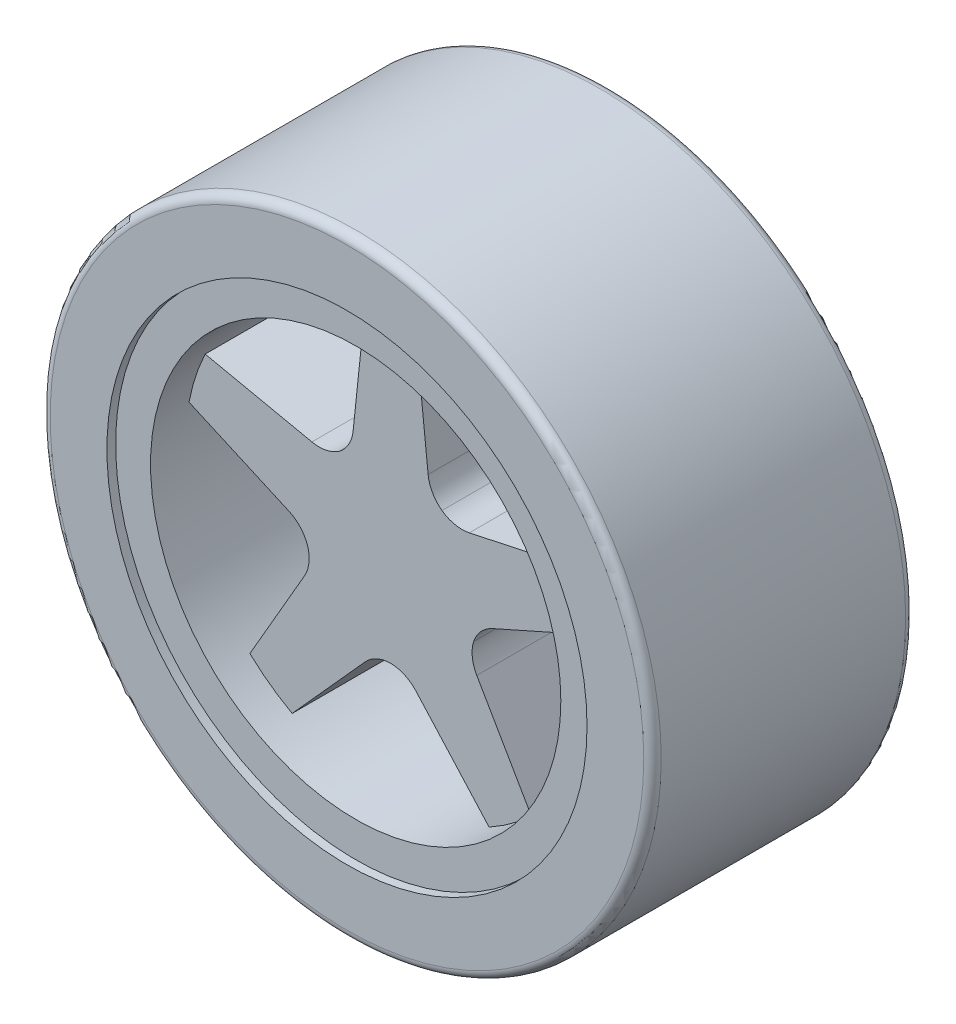
ISO-10303-21;
HEADER;
FILE_DESCRIPTION(('STEP AP214'),'2;1');
FILE_NAME('part.step','',(''),(''),'','','');
FILE_SCHEMA(('AUTOMOTIVE_DESIGN { 1 0 10303 214 1 1 1 1 }'));
ENDSEC;
DATA;
#1=APPLICATION_CONTEXT('core data for automotive mechanical design processes');
#2=APPLICATION_PROTOCOL_DEFINITION('international standard','automotive_design',2000,#1);
#3=PRODUCT_CONTEXT('',#1,'mechanical');
#4=PRODUCT('Part','Part','',(#3));
#5=PRODUCT_RELATED_PRODUCT_CATEGORY('part','',(#4));
#6=PRODUCT_DEFINITION_FORMATION('','',#4);
#7=PRODUCT_DEFINITION_CONTEXT('part definition',#1,'design');
#8=PRODUCT_DEFINITION('design','',#6,#7);
#9=PRODUCT_DEFINITION_SHAPE('','',#8);
#10=(LENGTH_UNIT() NAMED_UNIT(*) SI_UNIT(.MILLI.,.METRE.));
#11=(NAMED_UNIT(*) PLANE_ANGLE_UNIT() SI_UNIT($,.RADIAN.));
#12=(NAMED_UNIT(*) SI_UNIT($,.STERADIAN.) SOLID_ANGLE_UNIT());
#13=UNCERTAINTY_MEASURE_WITH_UNIT(LENGTH_MEASURE(1.E-05),#10,'distance_accuracy_value','');
#14=(GEOMETRIC_REPRESENTATION_CONTEXT(3) GLOBAL_UNCERTAINTY_ASSIGNED_CONTEXT((#13)) GLOBAL_UNIT_ASSIGNED_CONTEXT((#10,
#11,#12)) REPRESENTATION_CONTEXT('',''));
#15=CARTESIAN_POINT('',(0.,0.,0.));
#16=DIRECTION('',(0.,0.,1.));
#17=DIRECTION('',(1.,0.,0.));
#18=AXIS2_PLACEMENT_3D('',#15,#16,#17);
#19=CARTESIAN_POINT('',(0.,0.,14.));
#20=DIRECTION('',(0.,0.,-1.));
#21=DIRECTION('',(-1.,0.,0.));
#22=AXIS2_PLACEMENT_3D('',#19,#20,#21);
#23=CYLINDRICAL_SURFACE('',#22,23.5);
#24=CARTESIAN_POINT('',(0.,0.,14.));
#25=DIRECTION('',(0.,0.,1.));
#26=DIRECTION('',(1.,0.,0.));
#27=AXIS2_PLACEMENT_3D('',#24,#25,#26);
#28=CIRCLE('',#27,23.5);
#29=CARTESIAN_POINT('',(23.5,0.,14.));
#30=VERTEX_POINT('',#29);
#31=EDGE_CURVE('E366',#30,#30,#28,.T.);
#32=ORIENTED_EDGE('',*,*,#31,.T.);
#33=EDGE_LOOP('',(#32));
#34=FACE_BOUND('',#33,.T.);
#35=CARTESIAN_POINT('',(0.,0.,-14.));
#36=DIRECTION('',(0.,0.,1.));
#37=DIRECTION('',(1.,0.,0.));
#38=AXIS2_PLACEMENT_3D('',#35,#36,#37);
#39=CIRCLE('',#38,23.5);
#40=CARTESIAN_POINT('',(23.5,0.,-14.));
#41=VERTEX_POINT('',#40);
#42=EDGE_CURVE('E365',#41,#41,#39,.T.);
#43=ORIENTED_EDGE('',*,*,#42,.F.);
#44=EDGE_LOOP('',(#43));
#45=FACE_BOUND('',#44,.T.);
#46=DIRECTION('',(0.,0.,-1.));
#47=VECTOR('',#46,1.);
#48=CARTESIAN_POINT('',(-2.99388239988729,23.3085106382979,10.));
#49=LINE('',#48,#47);
#50=CARTESIAN_POINT('',(-2.9938823998873,23.3085106382979,10.));
#51=VERTEX_POINT('',#50);
#52=CARTESIAN_POINT('',(-2.99388239988729,23.3085106382979,-10.));
#53=VERTEX_POINT('',#52);
#54=EDGE_CURVE('E361',#51,#53,#49,.T.);
#55=ORIENTED_EDGE('',*,*,#54,.F.);
#56=CARTESIAN_POINT('',(0.,0.,10.));
#57=DIRECTION('',(0.,0.,1.));
#58=DIRECTION('',(-1.,0.,0.));
#59=AXIS2_PLACEMENT_3D('',#56,#57,#58);
#60=CIRCLE('',#59,23.5);
#61=CARTESIAN_POINT('',(2.9938823998873,23.3085106382979,10.));
#62=VERTEX_POINT('',#61);
#63=EDGE_CURVE('E338',#62,#51,#60,.T.);
#64=ORIENTED_EDGE('',*,*,#63,.F.);
#65=DIRECTION('',(0.,0.,-1.));
#66=VECTOR('',#65,1.);
#67=CARTESIAN_POINT('',(2.99388239988729,23.3085106382979,10.));
#68=LINE('',#67,#66);
#69=CARTESIAN_POINT('',(2.99388239988729,23.3085106382979,-10.));
#70=VERTEX_POINT('',#69);
#71=EDGE_CURVE('E349',#62,#70,#68,.T.);
#72=ORIENTED_EDGE('',*,*,#71,.T.);
#73=CARTESIAN_POINT('',(0.,0.,-10.));
#74=DIRECTION('',(0.,0.,1.));
#75=DIRECTION('',(-1.,0.,0.));
#76=AXIS2_PLACEMENT_3D('',#73,#74,#75);
#77=CIRCLE('',#76,23.5);
#78=EDGE_CURVE('E337',#70,#53,#77,.T.);
#79=ORIENTED_EDGE('',*,*,#78,.T.);
#80=EDGE_LOOP('',(#55,#64,#72,#79));
#81=FACE_BOUND('',#80,.T.);
#82=CARTESIAN_POINT('',(0.,0.,-10.));
#83=DIRECTION('',(0.,0.,1.));
#84=DIRECTION('',(0.809016994374951,0.587785252292469,0.));
#85=AXIS2_PLACEMENT_3D('',#82,#83,#84);
#86=CIRCLE('',#85,23.5);
#87=CARTESIAN_POINT('',(11.2782970654247,-20.6167411417041,-10.));
#88=VERTEX_POINT('',#87);
#89=CARTESIAN_POINT('',(16.1225005467625,-17.0972212982006,-10.));
#90=VERTEX_POINT('',#89);
#91=EDGE_CURVE('E279',#88,#90,#86,.T.);
#92=ORIENTED_EDGE('',*,*,#91,.T.);
#93=DIRECTION('',(0.,0.,-1.));
#94=VECTOR('',#93,1.);
#95=CARTESIAN_POINT('',(16.1225005467625,-17.0972212982006,10.));
#96=LINE('',#95,#94);
#97=CARTESIAN_POINT('',(16.1225005467625,-17.0972212982006,10.));
#98=VERTEX_POINT('',#97);
#99=EDGE_CURVE('E304',#98,#90,#96,.T.);
#100=ORIENTED_EDGE('',*,*,#99,.F.);
#101=CARTESIAN_POINT('',(0.,0.,10.));
#102=DIRECTION('',(0.,0.,1.));
#103=DIRECTION('',(0.809016994374951,0.587785252292469,0.));
#104=AXIS2_PLACEMENT_3D('',#101,#102,#103);
#105=CIRCLE('',#104,23.5);
#106=CARTESIAN_POINT('',(11.2782970654247,-20.6167411417041,10.));
#107=VERTEX_POINT('',#106);
#108=EDGE_CURVE('E297',#107,#98,#105,.T.);
#109=ORIENTED_EDGE('',*,*,#108,.F.);
#110=DIRECTION('',(0.,0.,-1.));
#111=VECTOR('',#110,1.);
#112=CARTESIAN_POINT('',(11.2782970654247,-20.6167411417041,10.));
#113=LINE('',#112,#111);
#114=EDGE_CURVE('E290',#107,#88,#113,.T.);
#115=ORIENTED_EDGE('',*,*,#114,.T.);
#116=EDGE_LOOP('',(#92,#100,#109,#115));
#117=FACE_BOUND('',#116,.T.);
#118=CARTESIAN_POINT('',(0.,0.,10.));
#119=DIRECTION('',(0.,0.,1.));
#120=DIRECTION('',(-0.309016994374958,-0.95105651629515,0.));
#121=AXIS2_PLACEMENT_3D('',#118,#119,#120);
#122=CIRCLE('',#121,23.5);
#123=CARTESIAN_POINT('',(-21.2425503869628,10.0500772662377,10.));
#124=VERTEX_POINT('',#123);
#125=CARTESIAN_POINT('',(-23.0928714684133,4.35537453536937,10.));
#126=VERTEX_POINT('',#125);
#127=EDGE_CURVE('E231',#124,#126,#122,.T.);
#128=ORIENTED_EDGE('',*,*,#127,.F.);
#129=DIRECTION('',(0.,0.,-1.));
#130=VECTOR('',#129,1.);
#131=CARTESIAN_POINT('',(-21.2425503869628,10.0500772662377,10.));
#132=LINE('',#131,#130);
#133=CARTESIAN_POINT('',(-21.2425503869628,10.0500772662377,-10.));
#134=VERTEX_POINT('',#133);
#135=EDGE_CURVE('E212',#124,#134,#132,.T.);
#136=ORIENTED_EDGE('',*,*,#135,.T.);
#137=CARTESIAN_POINT('',(0.,0.,-10.));
#138=DIRECTION('',(0.,0.,1.));
#139=DIRECTION('',(-0.309016994374958,-0.95105651629515,0.));
#140=AXIS2_PLACEMENT_3D('',#137,#138,#139);
#141=CIRCLE('',#140,23.5);
#142=CARTESIAN_POINT('',(-23.0928714684133,4.35537453536937,-10.));
#143=VERTEX_POINT('',#142);
#144=EDGE_CURVE('E218',#134,#143,#141,.T.);
#145=ORIENTED_EDGE('',*,*,#144,.T.);
#146=DIRECTION('',(0.,0.,-1.));
#147=VECTOR('',#146,1.);
#148=CARTESIAN_POINT('',(-23.0928714684133,4.35537453536937,10.));
#149=LINE('',#148,#147);
#150=EDGE_CURVE('E246',#126,#143,#149,.T.);
#151=ORIENTED_EDGE('',*,*,#150,.F.);
#152=EDGE_LOOP('',(#128,#136,#145,#151));
#153=FACE_BOUND('',#152,.T.);
#154=CARTESIAN_POINT('',(0.,0.,10.));
#155=DIRECTION('',(0.,0.,1.));
#156=DIRECTION('',(0.809016994374942,-0.58778525229248,0.));
#157=AXIS2_PLACEMENT_3D('',#154,#155,#156);
#158=CIRCLE('',#157,23.5);
#159=CARTESIAN_POINT('',(-16.1225005467627,-17.0972212982003,10.));
#160=VERTEX_POINT('',#159);
#161=CARTESIAN_POINT('',(-11.278297065425,-20.6167411417039,10.));
#162=VERTEX_POINT('',#161);
#163=EDGE_CURVE('E267',#160,#162,#158,.T.);
#164=ORIENTED_EDGE('',*,*,#163,.F.);
#165=DIRECTION('',(0.,0.,-1.));
#166=VECTOR('',#165,1.);
#167=CARTESIAN_POINT('',(-16.1225005467627,-17.0972212982003,10.));
#168=LINE('',#167,#166);
#169=CARTESIAN_POINT('',(-16.1225005467627,-17.0972212982003,-10.));
#170=VERTEX_POINT('',#169);
#171=EDGE_CURVE('E260',#160,#170,#168,.T.);
#172=ORIENTED_EDGE('',*,*,#171,.T.);
#173=CARTESIAN_POINT('',(0.,0.,-10.));
#174=DIRECTION('',(0.,0.,1.));
#175=DIRECTION('',(0.809016994374942,-0.58778525229248,0.));
#176=AXIS2_PLACEMENT_3D('',#173,#174,#175);
#177=CIRCLE('',#176,23.5);
#178=CARTESIAN_POINT('',(-11.278297065425,-20.6167411417039,-10.));
#179=VERTEX_POINT('',#178);
#180=EDGE_CURVE('E249',#170,#179,#177,.T.);
#181=ORIENTED_EDGE('',*,*,#180,.T.);
#182=DIRECTION('',(0.,0.,-1.));
#183=VECTOR('',#182,1.);
#184=CARTESIAN_POINT('',(-11.278297065425,-20.6167411417039,10.));
#185=LINE('',#184,#183);
#186=EDGE_CURVE('E275',#162,#179,#185,.T.);
#187=ORIENTED_EDGE('',*,*,#186,.F.);
#188=EDGE_LOOP('',(#164,#172,#181,#187));
#189=FACE_BOUND('',#188,.T.);
#190=CARTESIAN_POINT('',(0.,0.,-10.));
#191=DIRECTION('',(0.,0.,1.));
#192=DIRECTION('',(-0.309016994374945,0.951056516295155,0.));
#193=AXIS2_PLACEMENT_3D('',#190,#191,#192);
#194=CIRCLE('',#193,23.5);
#195=CARTESIAN_POINT('',(23.0928714684133,4.35537453536905,-10.));
#196=VERTEX_POINT('',#195);
#197=CARTESIAN_POINT('',(21.2425503869629,10.0500772662374,-10.));
#198=VERTEX_POINT('',#197);
#199=EDGE_CURVE('E308',#196,#198,#194,.T.);
#200=ORIENTED_EDGE('',*,*,#199,.T.);
#201=DIRECTION('',(0.,0.,-1.));
#202=VECTOR('',#201,1.);
#203=CARTESIAN_POINT('',(21.2425503869629,10.0500772662374,10.));
#204=LINE('',#203,#202);
#205=CARTESIAN_POINT('',(21.2425503869629,10.0500772662374,10.));
#206=VERTEX_POINT('',#205);
#207=EDGE_CURVE('E333',#206,#198,#204,.T.);
#208=ORIENTED_EDGE('',*,*,#207,.F.);
#209=CARTESIAN_POINT('',(0.,0.,10.));
#210=DIRECTION('',(0.,0.,1.));
#211=DIRECTION('',(-0.309016994374945,0.951056516295155,0.));
#212=AXIS2_PLACEMENT_3D('',#209,#210,#211);
#213=CIRCLE('',#212,23.5);
#214=CARTESIAN_POINT('',(23.0928714684133,4.35537453536904,10.));
#215=VERTEX_POINT('',#214);
#216=EDGE_CURVE('E325',#215,#206,#213,.T.);
#217=ORIENTED_EDGE('',*,*,#216,.F.);
#218=DIRECTION('',(0.,0.,-1.));
#219=VECTOR('',#218,1.);
#220=CARTESIAN_POINT('',(23.0928714684133,4.35537453536905,10.));
#221=LINE('',#220,#219);
#222=EDGE_CURVE('E318',#215,#196,#221,.T.);
#223=ORIENTED_EDGE('',*,*,#222,.T.);
#224=EDGE_LOOP('',(#200,#208,#217,#223));
#225=FACE_BOUND('',#224,.T.);
#226=ADVANCED_FACE('F39',(#34,#45,#81,#117,#153,#189,#225),#23,.F.);
#227=CARTESIAN_POINT('',(0.,0.,15.));
#228=DIRECTION('',(0.,0.,-1.));
#229=DIRECTION('',(-1.,0.,0.));
#230=AXIS2_PLACEMENT_3D('',#227,#228,#229);
#231=CYLINDRICAL_SURFACE('',#230,27.5);
#232=CARTESIAN_POINT('',(0.,0.,-15.));
#233=DIRECTION('',(0.,0.,1.));
#234=DIRECTION('',(1.,0.,0.));
#235=AXIS2_PLACEMENT_3D('',#232,#233,#234);
#236=CIRCLE('',#235,27.5);
#237=CARTESIAN_POINT('',(27.5,0.,-15.));
#238=VERTEX_POINT('',#237);
#239=EDGE_CURVE('E377',#238,#238,#236,.T.);
#240=ORIENTED_EDGE('',*,*,#239,.F.);
#241=EDGE_LOOP('',(#240));
#242=FACE_BOUND('',#241,.T.);
#243=CARTESIAN_POINT('',(0.,0.,-14.));
#244=DIRECTION('',(0.,0.,1.));
#245=DIRECTION('',(1.,0.,0.));
#246=AXIS2_PLACEMENT_3D('',#243,#244,#245);
#247=CIRCLE('',#246,27.5);
#248=CARTESIAN_POINT('',(27.5,0.,-14.));
#249=VERTEX_POINT('',#248);
#250=EDGE_CURVE('E370',#249,#249,#247,.T.);
#251=ORIENTED_EDGE('',*,*,#250,.T.);
#252=EDGE_LOOP('',(#251));
#253=FACE_BOUND('',#252,.T.);
#254=ADVANCED_FACE('F615',(#242,#253),#231,.F.);
#255=CARTESIAN_POINT('',(0.,0.,15.));
#256=DIRECTION('',(0.,0.,1.));
#257=DIRECTION('',(1.,0.,0.));
#258=AXIS2_PLACEMENT_3D('',#255,#256,#257);
#259=PLANE('',#258);
#260=CARTESIAN_POINT('',(0.,0.,15.));
#261=DIRECTION('',(0.,0.,1.));
#262=DIRECTION('',(1.,0.,0.));
#263=AXIS2_PLACEMENT_3D('',#260,#261,#262);
#264=CIRCLE('',#263,34.);
#265=CARTESIAN_POINT('',(34.,0.,15.));
#266=VERTEX_POINT('',#265);
#267=EDGE_CURVE('E397',#266,#266,#264,.T.);
#268=ORIENTED_EDGE('',*,*,#267,.T.);
#269=EDGE_LOOP('',(#268));
#270=FACE_BOUND('',#269,.T.);
#271=CARTESIAN_POINT('',(0.,0.,15.));
#272=DIRECTION('',(0.,0.,1.));
#273=DIRECTION('',(1.,0.,0.));
#274=AXIS2_PLACEMENT_3D('',#271,#272,#273);
#275=CIRCLE('',#274,27.5);
#276=CARTESIAN_POINT('',(27.5,0.,15.));
#277=VERTEX_POINT('',#276);
#278=EDGE_CURVE('E378',#277,#277,#275,.T.);
#279=ORIENTED_EDGE('',*,*,#278,.F.);
#280=EDGE_LOOP('',(#279));
#281=FACE_BOUND('',#280,.T.);
#282=ADVANCED_FACE('F620',(#270,#281),#259,.T.);
#283=CARTESIAN_POINT('',(0.,0.,-15.));
#284=DIRECTION('',(0.,0.,1.));
#285=DIRECTION('',(1.,0.,0.));
#286=AXIS2_PLACEMENT_3D('',#283,#284,#285);
#287=PLANE('',#286);
#288=CARTESIAN_POINT('',(0.,0.,-15.));
#289=DIRECTION('',(0.,0.,1.));
#290=DIRECTION('',(1.,0.,0.));
#291=AXIS2_PLACEMENT_3D('',#288,#289,#290);
#292=CIRCLE('',#291,34.);
#293=CARTESIAN_POINT('',(34.,0.,-15.));
#294=VERTEX_POINT('',#293);
#295=EDGE_CURVE('E393',#294,#294,#292,.F.);
#296=ORIENTED_EDGE('',*,*,#295,.T.);
#297=EDGE_LOOP('',(#296));
#298=FACE_BOUND('',#297,.T.);
#299=ORIENTED_EDGE('',*,*,#239,.T.);
#300=EDGE_LOOP('',(#299));
#301=FACE_BOUND('',#300,.T.);
#302=ADVANCED_FACE('F636',(#298,#301),#287,.F.);
#303=CARTESIAN_POINT('',(0.,0.,15.));
#304=DIRECTION('',(0.,0.,-1.));
#305=DIRECTION('',(-1.,0.,0.));
#306=AXIS2_PLACEMENT_3D('',#303,#304,#305);
#307=CYLINDRICAL_SURFACE('',#306,35.);
#308=CARTESIAN_POINT('',(0.,0.,-14.));
#309=DIRECTION('',(0.,0.,1.));
#310=DIRECTION('',(1.,0.,0.));
#311=AXIS2_PLACEMENT_3D('',#308,#309,#310);
#312=CIRCLE('',#311,35.);
#313=CARTESIAN_POINT('',(35.,0.,-14.));
#314=VERTEX_POINT('',#313);
#315=EDGE_CURVE('E389',#314,#314,#312,.T.);
#316=ORIENTED_EDGE('',*,*,#315,.T.);
#317=EDGE_LOOP('',(#316));
#318=FACE_BOUND('',#317,.T.);
#319=CARTESIAN_POINT('',(0.,0.,14.));
#320=DIRECTION('',(0.,0.,1.));
#321=DIRECTION('',(1.,0.,0.));
#322=AXIS2_PLACEMENT_3D('',#319,#320,#321);
#323=CIRCLE('',#322,35.);
#324=CARTESIAN_POINT('',(35.,0.,14.));
#325=VERTEX_POINT('',#324);
#326=EDGE_CURVE('E382',#325,#325,#323,.F.);
#327=ORIENTED_EDGE('',*,*,#326,.T.);
#328=EDGE_LOOP('',(#327));
#329=FACE_BOUND('',#328,.T.);
#330=ADVANCED_FACE('F632',(#318,#329),#307,.T.);
#331=CARTESIAN_POINT('',(0.,0.,14.));
#332=DIRECTION('',(0.,0.,1.));
#333=DIRECTION('',(1.,0.,0.));
#334=AXIS2_PLACEMENT_3D('',#331,#332,#333);
#335=CIRCLE('',#334,27.5);
#336=CARTESIAN_POINT('',(27.5,0.,14.));
#337=VERTEX_POINT('',#336);
#338=EDGE_CURVE('E401',#337,#337,#335,.T.);
#339=ORIENTED_EDGE('',*,*,#338,.F.);
#340=EDGE_LOOP('',(#339));
#341=FACE_BOUND('',#340,.T.);
#342=ORIENTED_EDGE('',*,*,#278,.T.);
#343=EDGE_LOOP('',(#342));
#344=FACE_BOUND('',#343,.T.);
#345=ADVANCED_FACE('F623',(#341,#344),#231,.F.);
#346=CARTESIAN_POINT('',(0.,0.,-14.));
#347=DIRECTION('',(0.,0.,1.));
#348=DIRECTION('',(1.,0.,0.));
#349=AXIS2_PLACEMENT_3D('',#346,#347,#348);
#350=TOROIDAL_SURFACE('',#349,34.,1.);
#351=ORIENTED_EDGE('',*,*,#295,.F.);
#352=EDGE_LOOP('',(#351));
#353=FACE_BOUND('',#352,.T.);
#354=ORIENTED_EDGE('',*,*,#315,.F.);
#355=EDGE_LOOP('',(#354));
#356=FACE_BOUND('',#355,.T.);
#357=ADVANCED_FACE('F631',(#353,#356),#350,.T.);
#358=CARTESIAN_POINT('',(0.,0.,14.));
#359=DIRECTION('',(0.,0.,1.));
#360=DIRECTION('',(1.,0.,0.));
#361=AXIS2_PLACEMENT_3D('',#358,#359,#360);
#362=TOROIDAL_SURFACE('',#361,34.,1.);
#363=ORIENTED_EDGE('',*,*,#326,.F.);
#364=EDGE_LOOP('',(#363));
#365=FACE_BOUND('',#364,.T.);
#366=ORIENTED_EDGE('',*,*,#267,.F.);
#367=EDGE_LOOP('',(#366));
#368=FACE_BOUND('',#367,.T.);
#369=ADVANCED_FACE('F627',(#365,#368),#362,.T.);
#370=CARTESIAN_POINT('',(0.,0.,14.));
#371=DIRECTION('',(0.,0.,1.));
#372=DIRECTION('',(1.,0.,0.));
#373=AXIS2_PLACEMENT_3D('',#370,#371,#372);
#374=PLANE('',#373);
#375=ORIENTED_EDGE('',*,*,#338,.T.);
#376=EDGE_LOOP('',(#375));
#377=FACE_BOUND('',#376,.T.);
#378=ORIENTED_EDGE('',*,*,#31,.F.);
#379=EDGE_LOOP('',(#378));
#380=FACE_BOUND('',#379,.T.);
#381=ADVANCED_FACE('F610',(#377,#380),#374,.T.);
#382=CARTESIAN_POINT('',(0.,0.,-14.));
#383=DIRECTION('',(0.,0.,1.));
#384=DIRECTION('',(1.,0.,0.));
#385=AXIS2_PLACEMENT_3D('',#382,#383,#384);
#386=PLANE('',#385);
#387=ORIENTED_EDGE('',*,*,#250,.F.);
#388=EDGE_LOOP('',(#387));
#389=FACE_BOUND('',#388,.T.);
#390=ORIENTED_EDGE('',*,*,#42,.T.);
#391=EDGE_LOOP('',(#390));
#392=FACE_BOUND('',#391,.T.);
#393=ADVANCED_FACE('F603',(#389,#392),#386,.F.);
#394=CARTESIAN_POINT('',(-2.99388239988729,23.3085106382979,10.));
#395=DIRECTION('',(0.994558469357222,-0.104179897436208,0.));
#396=DIRECTION('',(0.104179897436208,0.994558469357222,0.));
#397=AXIS2_PLACEMENT_3D('',#394,#395,#396);
#398=PLANE('',#397);
#399=DIRECTION('',(-0.104179897436208,-0.994558469357222,0.));
#400=VECTOR('',#399,1.);
#401=CARTESIAN_POINT('',(-2.99388239988729,23.3085106382979,-10.));
#402=LINE('',#401,#400);
#403=CARTESIAN_POINT('',(-4.29614416433073,10.8764052223719,-10.));
#404=VERTEX_POINT('',#403);
#405=EDGE_CURVE('E352',#53,#404,#402,.T.);
#406=ORIENTED_EDGE('',*,*,#405,.T.);
#407=DIRECTION('',(0.,0.,1.));
#408=VECTOR('',#407,1.);
#409=CARTESIAN_POINT('',(-4.29614416433073,10.8764052223719,10.));
#410=LINE('',#409,#408);
#411=CARTESIAN_POINT('',(-4.29614416433073,10.8764052223719,10.));
#412=VERTEX_POINT('',#411);
#413=EDGE_CURVE('E433',#404,#412,#410,.T.);
#414=ORIENTED_EDGE('',*,*,#413,.T.);
#415=DIRECTION('',(-0.104179897436208,-0.994558469357222,0.));
#416=VECTOR('',#415,1.);
#417=CARTESIAN_POINT('',(-2.99388239988729,23.3085106382979,10.));
#418=LINE('',#417,#416);
#419=EDGE_CURVE('E342',#51,#412,#418,.T.);
#420=ORIENTED_EDGE('',*,*,#419,.F.);
#421=ORIENTED_EDGE('',*,*,#54,.T.);
#422=EDGE_LOOP('',(#406,#414,#420,#421));
#423=FACE_BOUND('',#422,.T.);
#424=ADVANCED_FACE('F601',(#423),#398,.F.);
#425=CARTESIAN_POINT('',(2.99388239988729,23.3085106382979,10.));
#426=DIRECTION('',(-0.994558469357222,-0.104179897436208,0.));
#427=DIRECTION('',(0.104179897436208,-0.994558469357222,0.));
#428=AXIS2_PLACEMENT_3D('',#425,#426,#427);
#429=PLANE('',#428);
#430=DIRECTION('',(-0.104179897436208,0.994558469357222,0.));
#431=VECTOR('',#430,1.);
#432=CARTESIAN_POINT('',(2.99388239988729,23.3085106382979,10.));
#433=LINE('',#432,#431);
#434=CARTESIAN_POINT('',(4.29614416433073,10.8764052223719,10.));
#435=VERTEX_POINT('',#434);
#436=EDGE_CURVE('E346',#435,#62,#433,.T.);
#437=ORIENTED_EDGE('',*,*,#436,.F.);
#438=DIRECTION('',(0.,0.,1.));
#439=VECTOR('',#438,1.);
#440=CARTESIAN_POINT('',(4.29614416433073,10.8764052223719,-10.));
#441=LINE('',#440,#439);
#442=CARTESIAN_POINT('',(4.29614416433073,10.8764052223719,-10.));
#443=VERTEX_POINT('',#442);
#444=EDGE_CURVE('E430',#435,#443,#441,.F.);
#445=ORIENTED_EDGE('',*,*,#444,.T.);
#446=DIRECTION('',(-0.104179897436208,0.994558469357222,0.));
#447=VECTOR('',#446,1.);
#448=CARTESIAN_POINT('',(2.99388239988729,23.3085106382979,-10.));
#449=LINE('',#448,#447);
#450=EDGE_CURVE('E343',#443,#70,#449,.T.);
#451=ORIENTED_EDGE('',*,*,#450,.T.);
#452=ORIENTED_EDGE('',*,*,#71,.F.);
#453=EDGE_LOOP('',(#437,#445,#451,#452));
#454=FACE_BOUND('',#453,.T.);
#455=ADVANCED_FACE('F593',(#454),#429,.F.);
#456=CARTESIAN_POINT('',(0.,0.,10.));
#457=DIRECTION('',(0.,0.,-1.));
#458=DIRECTION('',(-1.,0.,0.));
#459=AXIS2_PLACEMENT_3D('',#456,#457,#458);
#460=PLANE('',#459);
#461=CARTESIAN_POINT('',(8.18347650911149,11.3591686414465,10.));
#462=DIRECTION('',(0.,0.,-1.));
#463=DIRECTION('',(-1.,0.,0.));
#464=AXIS2_PLACEMENT_3D('',#461,#462,#463);
#465=CIRCLE('',#464,4.);
#466=CARTESIAN_POINT('',(9.01649450354047,7.44686995385145,10.));
#467=VERTEX_POINT('',#466);
#468=CARTESIAN_POINT('',(5.87801817507618,8.0903979443759,10.));
#469=VERTEX_POINT('',#468);
#470=EDGE_CURVE('E478',#467,#469,#465,.T.);
#471=ORIENTED_EDGE('',*,*,#470,.T.);
#472=CARTESIAN_POINT('',(8.27437804175962,11.2931248121167,10.));
#473=DIRECTION('',(0.,0.,-1.));
#474=DIRECTION('',(-1.,0.,0.));
#475=AXIS2_PLACEMENT_3D('',#472,#473,#474);
#476=CIRCLE('',#475,4.);
#477=EDGE_CURVE('E484',#469,#435,#476,.T.);
#478=ORIENTED_EDGE('',*,*,#477,.T.);
#479=ORIENTED_EDGE('',*,*,#436,.T.);
#480=ORIENTED_EDGE('',*,*,#63,.T.);
#481=ORIENTED_EDGE('',*,*,#419,.T.);
#482=CARTESIAN_POINT('',(-8.27437804175962,11.2931248121167,10.));
#483=DIRECTION('',(0.,0.,-1.));
#484=DIRECTION('',(-1.,0.,0.));
#485=AXIS2_PLACEMENT_3D('',#482,#483,#484);
#486=CIRCLE('',#485,4.);
#487=CARTESIAN_POINT('',(-5.87801817507623,8.09039794437586,10.));
#488=VERTEX_POINT('',#487);
#489=EDGE_CURVE('E56',#412,#488,#486,.T.);
#490=ORIENTED_EDGE('',*,*,#489,.T.);
#491=CARTESIAN_POINT('',(-8.18347650911133,11.3591686414466,10.));
#492=DIRECTION('',(0.,0.,-1.));
#493=DIRECTION('',(-1.,0.,0.));
#494=AXIS2_PLACEMENT_3D('',#491,#492,#493);
#495=CIRCLE('',#494,4.);
#496=CARTESIAN_POINT('',(-9.01649450354038,7.44686995385158,10.));
#497=VERTEX_POINT('',#496);
#498=EDGE_CURVE('E11',#488,#497,#495,.T.);
#499=ORIENTED_EDGE('',*,*,#498,.T.);
#500=DIRECTION('',(-0.978074671898745,0.208254498607262,0.));
#501=VECTOR('',#500,1.);
#502=CARTESIAN_POINT('',(-21.2425503869628,10.0500772662377,10.));
#503=LINE('',#502,#501);
#504=EDGE_CURVE('E233',#497,#124,#503,.T.);
#505=ORIENTED_EDGE('',*,*,#504,.T.);
#506=ORIENTED_EDGE('',*,*,#127,.T.);
#507=DIRECTION('',(0.913687954338688,-0.406416439254594,0.));
#508=VECTOR('',#507,1.);
#509=CARTESIAN_POINT('',(-23.0928714684133,4.35537453536937,10.));
#510=LINE('',#509,#508);
#511=CARTESIAN_POINT('',(-11.6716576176664,-0.724881851008666,10.));
#512=VERTEX_POINT('',#511);
#513=EDGE_CURVE('E242',#126,#512,#510,.T.);
#514=ORIENTED_EDGE('',*,*,#513,.T.);
#515=CARTESIAN_POINT('',(-13.2973233746848,-4.37963366836342,10.));
#516=DIRECTION('',(0.,0.,-1.));
#517=DIRECTION('',(-1.,0.,0.));
#518=AXIS2_PLACEMENT_3D('',#515,#516,#517);
#519=CIRCLE('',#518,4.);
#520=CARTESIAN_POINT('',(-9.51083319376296,-3.09025703223927,10.));
#521=VERTEX_POINT('',#520);
#522=EDGE_CURVE('E448',#512,#521,#519,.T.);
#523=ORIENTED_EDGE('',*,*,#522,.T.);
#524=CARTESIAN_POINT('',(-13.3320446705269,-4.27277250776071,10.));
#525=DIRECTION('',(0.,0.,-1.));
#526=DIRECTION('',(-1.,0.,0.));
#527=AXIS2_PLACEMENT_3D('',#524,#525,#526);
#528=CIRCLE('',#527,4.);
#529=CARTESIAN_POINT('',(-9.86864422689541,-6.27398648109122,10.));
#530=VERTEX_POINT('',#529);
#531=EDGE_CURVE('E442',#521,#530,#528,.T.);
#532=ORIENTED_EDGE('',*,*,#531,.T.);
#533=DIRECTION('',(-0.500303493332627,-0.86585011090787,0.));
#534=VECTOR('',#533,1.);
#535=CARTESIAN_POINT('',(-16.1225005467627,-17.0972212982003,10.));
#536=LINE('',#535,#534);
#537=EDGE_CURVE('E264',#530,#160,#536,.T.);
#538=ORIENTED_EDGE('',*,*,#537,.T.);
#539=ORIENTED_EDGE('',*,*,#163,.T.);
#540=DIRECTION('',(0.668870108328889,0.743379296311177,0.));
#541=VECTOR('',#540,1.);
#542=CARTESIAN_POINT('',(-11.278297065425,-20.6167411417039,10.));
#543=LINE('',#542,#541);
#544=CARTESIAN_POINT('',(-2.91733694843881,-11.3244068441232,10.));
#545=VERTEX_POINT('',#544);
#546=EDGE_CURVE('E271',#162,#545,#543,.T.);
#547=ORIENTED_EDGE('',*,*,#546,.T.);
#548=CARTESIAN_POINT('',(0.0561802368058903,-13.9998872774388,10.));
#549=DIRECTION('',(0.,0.,-1.));
#550=DIRECTION('',(-1.,0.,0.));
#551=AXIS2_PLACEMENT_3D('',#548,#549,#550);
#552=CIRCLE('',#551,4.);
#553=CARTESIAN_POINT('',(-1.05818132034585E-13,-10.0002818242731,10.));
#554=VERTEX_POINT('',#553);
#555=EDGE_CURVE('E460',#545,#554,#552,.T.);
#556=ORIENTED_EDGE('',*,*,#555,.T.);
#557=CARTESIAN_POINT('',(-0.0561802368061019,-13.9998872774388,10.));
#558=DIRECTION('',(0.,0.,-1.));
#559=DIRECTION('',(-1.,0.,0.));
#560=AXIS2_PLACEMENT_3D('',#557,#558,#559);
#561=CIRCLE('',#560,4.);
#562=CARTESIAN_POINT('',(2.91733694843864,-11.3244068441233,10.));
#563=VERTEX_POINT('',#562);
#564=EDGE_CURVE('E454',#554,#563,#561,.T.);
#565=ORIENTED_EDGE('',*,*,#564,.T.);
#566=DIRECTION('',(0.668870108328878,-0.743379296311186,0.));
#567=VECTOR('',#566,1.);
#568=CARTESIAN_POINT('',(11.2782970654247,-20.6167411417041,10.));
#569=LINE('',#568,#567);
#570=EDGE_CURVE('E294',#563,#107,#569,.T.);
#571=ORIENTED_EDGE('',*,*,#570,.T.);
#572=ORIENTED_EDGE('',*,*,#108,.T.);
#573=DIRECTION('',(-0.500303493332614,0.865850110907877,0.));
#574=VECTOR('',#573,1.);
#575=CARTESIAN_POINT('',(16.1225005467625,-17.0972212982006,10.));
#576=LINE('',#575,#574);
#577=CARTESIAN_POINT('',(9.86864422689531,-6.27398648109136,10.));
#578=VERTEX_POINT('',#577);
#579=EDGE_CURVE('E300',#98,#578,#576,.T.);
#580=ORIENTED_EDGE('',*,*,#579,.T.);
#581=CARTESIAN_POINT('',(13.3320446705268,-4.27277250776091,10.));
#582=DIRECTION('',(0.,0.,-1.));
#583=DIRECTION('',(-1.,0.,0.));
#584=AXIS2_PLACEMENT_3D('',#581,#582,#583);
#585=CIRCLE('',#584,4.);
#586=CARTESIAN_POINT('',(9.51083319376291,-3.09025703223944,10.));
#587=VERTEX_POINT('',#586);
#588=EDGE_CURVE('E472',#578,#587,#585,.T.);
#589=ORIENTED_EDGE('',*,*,#588,.T.);
#590=CARTESIAN_POINT('',(13.2973233746847,-4.37963366836362,10.));
#591=DIRECTION('',(0.,0.,-1.));
#592=DIRECTION('',(-1.,0.,0.));
#593=AXIS2_PLACEMENT_3D('',#590,#591,#592);
#594=CIRCLE('',#593,4.);
#595=CARTESIAN_POINT('',(11.6716576176664,-0.724881851008839,10.));
#596=VERTEX_POINT('',#595);
#597=EDGE_CURVE('E466',#587,#596,#594,.T.);
#598=ORIENTED_EDGE('',*,*,#597,.T.);
#599=DIRECTION('',(0.913687954338694,0.406416439254581,0.));
#600=VECTOR('',#599,1.);
#601=CARTESIAN_POINT('',(23.0928714684133,4.35537453536905,10.));
#602=LINE('',#601,#600);
#603=EDGE_CURVE('E322',#596,#215,#602,.T.);
#604=ORIENTED_EDGE('',*,*,#603,.T.);
#605=ORIENTED_EDGE('',*,*,#216,.T.);
#606=DIRECTION('',(-0.978074671898749,-0.208254498607248,0.));
#607=VECTOR('',#606,1.);
#608=CARTESIAN_POINT('',(21.2425503869629,10.0500772662374,10.));
#609=LINE('',#608,#607);
#610=EDGE_CURVE('E329',#206,#467,#609,.T.);
#611=ORIENTED_EDGE('',*,*,#610,.T.);
#612=EDGE_LOOP('',(#471,#478,#479,#480,#481,#490,#499,#505,#506,#514,#523,#532,#538,#539,#547,
#556,#565,#571,#572,#580,#589,#598,#604,#605,#611));
#613=FACE_BOUND('',#612,.T.);
#614=ADVANCED_FACE('F517',(#613),#460,.F.);
#615=CARTESIAN_POINT('',(0.,0.,-10.));
#616=DIRECTION('',(0.,0.,-1.));
#617=DIRECTION('',(-1.,0.,0.));
#618=AXIS2_PLACEMENT_3D('',#615,#616,#617);
#619=PLANE('',#618);
#620=DIRECTION('',(-0.978074671898745,0.208254498607262,0.));
#621=VECTOR('',#620,1.);
#622=CARTESIAN_POINT('',(-21.2425503869628,10.0500772662377,-10.));
#623=LINE('',#622,#621);
#624=CARTESIAN_POINT('',(-9.01649450354038,7.44686995385158,-10.));
#625=VERTEX_POINT('',#624);
#626=EDGE_CURVE('E207',#625,#134,#623,.T.);
#627=ORIENTED_EDGE('',*,*,#626,.F.);
#628=CARTESIAN_POINT('',(-8.18347650911133,11.3591686414466,-10.));
#629=DIRECTION('',(0.,0.,-1.));
#630=DIRECTION('',(-1.,0.,0.));
#631=AXIS2_PLACEMENT_3D('',#628,#629,#630);
#632=CIRCLE('',#631,4.);
#633=CARTESIAN_POINT('',(-5.87801817507623,8.09039794437586,-10.));
#634=VERTEX_POINT('',#633);
#635=EDGE_CURVE('E49',#625,#634,#632,.F.);
#636=ORIENTED_EDGE('',*,*,#635,.T.);
#637=CARTESIAN_POINT('',(-8.27437804175962,11.2931248121167,-10.));
#638=DIRECTION('',(0.,0.,-1.));
#639=DIRECTION('',(-1.,0.,0.));
#640=AXIS2_PLACEMENT_3D('',#637,#638,#639);
#641=CIRCLE('',#640,4.);
#642=EDGE_CURVE('E487',#634,#404,#641,.F.);
#643=ORIENTED_EDGE('',*,*,#642,.T.);
#644=ORIENTED_EDGE('',*,*,#405,.F.);
#645=ORIENTED_EDGE('',*,*,#78,.F.);
#646=ORIENTED_EDGE('',*,*,#450,.F.);
#647=CARTESIAN_POINT('',(8.27437804175962,11.2931248121167,-10.));
#648=DIRECTION('',(0.,0.,-1.));
#649=DIRECTION('',(-1.,0.,0.));
#650=AXIS2_PLACEMENT_3D('',#647,#648,#649);
#651=CIRCLE('',#650,4.);
#652=CARTESIAN_POINT('',(5.87801817507618,8.0903979443759,-10.));
#653=VERTEX_POINT('',#652);
#654=EDGE_CURVE('E481',#443,#653,#651,.F.);
#655=ORIENTED_EDGE('',*,*,#654,.T.);
#656=CARTESIAN_POINT('',(8.18347650911149,11.3591686414465,-10.));
#657=DIRECTION('',(0.,0.,-1.));
#658=DIRECTION('',(-1.,0.,0.));
#659=AXIS2_PLACEMENT_3D('',#656,#657,#658);
#660=CIRCLE('',#659,4.);
#661=CARTESIAN_POINT('',(9.01649450354047,7.44686995385145,-10.));
#662=VERTEX_POINT('',#661);
#663=EDGE_CURVE('E475',#653,#662,#660,.F.);
#664=ORIENTED_EDGE('',*,*,#663,.T.);
#665=DIRECTION('',(-0.978074671898749,-0.208254498607248,0.));
#666=VECTOR('',#665,1.);
#667=CARTESIAN_POINT('',(21.2425503869629,10.0500772662374,-10.));
#668=LINE('',#667,#666);
#669=EDGE_CURVE('E314',#198,#662,#668,.T.);
#670=ORIENTED_EDGE('',*,*,#669,.F.);
#671=ORIENTED_EDGE('',*,*,#199,.F.);
#672=DIRECTION('',(0.913687954338694,0.406416439254581,0.));
#673=VECTOR('',#672,1.);
#674=CARTESIAN_POINT('',(23.0928714684133,4.35537453536905,-10.));
#675=LINE('',#674,#673);
#676=CARTESIAN_POINT('',(11.6716576176664,-0.724881851008839,-10.));
#677=VERTEX_POINT('',#676);
#678=EDGE_CURVE('E311',#677,#196,#675,.T.);
#679=ORIENTED_EDGE('',*,*,#678,.F.);
#680=CARTESIAN_POINT('',(13.2973233746847,-4.37963366836362,-10.));
#681=DIRECTION('',(0.,0.,-1.));
#682=DIRECTION('',(-1.,0.,0.));
#683=AXIS2_PLACEMENT_3D('',#680,#681,#682);
#684=CIRCLE('',#683,4.);
#685=CARTESIAN_POINT('',(9.51083319376291,-3.09025703223944,-10.));
#686=VERTEX_POINT('',#685);
#687=EDGE_CURVE('E463',#677,#686,#684,.F.);
#688=ORIENTED_EDGE('',*,*,#687,.T.);
#689=CARTESIAN_POINT('',(13.3320446705268,-4.27277250776091,-10.));
#690=DIRECTION('',(0.,0.,-1.));
#691=DIRECTION('',(-1.,0.,0.));
#692=AXIS2_PLACEMENT_3D('',#689,#690,#691);
#693=CIRCLE('',#692,4.);
#694=CARTESIAN_POINT('',(9.86864422689531,-6.27398648109136,-10.));
#695=VERTEX_POINT('',#694);
#696=EDGE_CURVE('E469',#686,#695,#693,.F.);
#697=ORIENTED_EDGE('',*,*,#696,.T.);
#698=DIRECTION('',(-0.500303493332614,0.865850110907877,0.));
#699=VECTOR('',#698,1.);
#700=CARTESIAN_POINT('',(16.1225005467625,-17.0972212982006,-10.));
#701=LINE('',#700,#699);
#702=EDGE_CURVE('E286',#90,#695,#701,.T.);
#703=ORIENTED_EDGE('',*,*,#702,.F.);
#704=ORIENTED_EDGE('',*,*,#91,.F.);
#705=DIRECTION('',(0.668870108328878,-0.743379296311186,0.));
#706=VECTOR('',#705,1.);
#707=CARTESIAN_POINT('',(11.2782970654247,-20.6167411417041,-10.));
#708=LINE('',#707,#706);
#709=CARTESIAN_POINT('',(2.91733694843864,-11.3244068441233,-10.));
#710=VERTEX_POINT('',#709);
#711=EDGE_CURVE('E283',#710,#88,#708,.T.);
#712=ORIENTED_EDGE('',*,*,#711,.F.);
#713=CARTESIAN_POINT('',(-0.0561802368061019,-13.9998872774388,-10.));
#714=DIRECTION('',(0.,0.,-1.));
#715=DIRECTION('',(-1.,0.,0.));
#716=AXIS2_PLACEMENT_3D('',#713,#714,#715);
#717=CIRCLE('',#716,4.);
#718=CARTESIAN_POINT('',(-1.05818132034585E-13,-10.0002818242731,-10.));
#719=VERTEX_POINT('',#718);
#720=EDGE_CURVE('E451',#710,#719,#717,.F.);
#721=ORIENTED_EDGE('',*,*,#720,.T.);
#722=CARTESIAN_POINT('',(0.0561802368058903,-13.9998872774388,-10.));
#723=DIRECTION('',(0.,0.,-1.));
#724=DIRECTION('',(-1.,0.,0.));
#725=AXIS2_PLACEMENT_3D('',#722,#723,#724);
#726=CIRCLE('',#725,4.);
#727=CARTESIAN_POINT('',(-2.91733694843881,-11.3244068441232,-10.));
#728=VERTEX_POINT('',#727);
#729=EDGE_CURVE('E457',#719,#728,#726,.F.);
#730=ORIENTED_EDGE('',*,*,#729,.T.);
#731=DIRECTION('',(0.668870108328889,0.743379296311177,0.));
#732=VECTOR('',#731,1.);
#733=CARTESIAN_POINT('',(-11.278297065425,-20.6167411417039,-10.));
#734=LINE('',#733,#732);
#735=EDGE_CURVE('E256',#179,#728,#734,.T.);
#736=ORIENTED_EDGE('',*,*,#735,.F.);
#737=ORIENTED_EDGE('',*,*,#180,.F.);
#738=DIRECTION('',(-0.500303493332627,-0.86585011090787,0.));
#739=VECTOR('',#738,1.);
#740=CARTESIAN_POINT('',(-16.1225005467627,-17.0972212982003,-10.));
#741=LINE('',#740,#739);
#742=CARTESIAN_POINT('',(-9.86864422689541,-6.27398648109122,-10.));
#743=VERTEX_POINT('',#742);
#744=EDGE_CURVE('E253',#743,#170,#741,.T.);
#745=ORIENTED_EDGE('',*,*,#744,.F.);
#746=CARTESIAN_POINT('',(-13.3320446705269,-4.27277250776071,-10.));
#747=DIRECTION('',(0.,0.,-1.));
#748=DIRECTION('',(-1.,0.,0.));
#749=AXIS2_PLACEMENT_3D('',#746,#747,#748);
#750=CIRCLE('',#749,4.);
#751=CARTESIAN_POINT('',(-9.51083319376296,-3.09025703223927,-10.));
#752=VERTEX_POINT('',#751);
#753=EDGE_CURVE('E439',#743,#752,#750,.F.);
#754=ORIENTED_EDGE('',*,*,#753,.T.);
#755=CARTESIAN_POINT('',(-13.2973233746848,-4.37963366836342,-10.));
#756=DIRECTION('',(0.,0.,-1.));
#757=DIRECTION('',(-1.,0.,0.));
#758=AXIS2_PLACEMENT_3D('',#755,#756,#757);
#759=CIRCLE('',#758,4.);
#760=CARTESIAN_POINT('',(-11.6716576176664,-0.724881851008666,-10.));
#761=VERTEX_POINT('',#760);
#762=EDGE_CURVE('E445',#752,#761,#759,.F.);
#763=ORIENTED_EDGE('',*,*,#762,.T.);
#764=DIRECTION('',(0.913687954338688,-0.406416439254594,0.));
#765=VECTOR('',#764,1.);
#766=CARTESIAN_POINT('',(-23.0928714684133,4.35537453536937,-10.));
#767=LINE('',#766,#765);
#768=EDGE_CURVE('E217',#143,#761,#767,.T.);
#769=ORIENTED_EDGE('',*,*,#768,.F.);
#770=ORIENTED_EDGE('',*,*,#144,.F.);
#771=EDGE_LOOP('',(#627,#636,#643,#644,#645,#646,#655,#664,#670,#671,#679,#688,#697,#703,#704,
#712,#721,#730,#736,#737,#745,#754,#763,#769,#770));
#772=FACE_BOUND('',#771,.T.);
#773=ADVANCED_FACE('F221',(#772),#619,.T.);
#774=CARTESIAN_POINT('',(11.2782970654247,-20.6167411417041,10.));
#775=DIRECTION('',(0.743379296311186,0.668870108328878,0.));
#776=DIRECTION('',(-0.668870108328878,0.743379296311186,0.));
#777=AXIS2_PLACEMENT_3D('',#774,#775,#776);
#778=PLANE('',#777);
#779=ORIENTED_EDGE('',*,*,#570,.F.);
#780=DIRECTION('',(0.,0.,1.));
#781=VECTOR('',#780,1.);
#782=CARTESIAN_POINT('',(2.91733694843865,-11.3244068441233,-10.));
#783=LINE('',#782,#781);
#784=EDGE_CURVE('E412',#563,#710,#783,.F.);
#785=ORIENTED_EDGE('',*,*,#784,.T.);
#786=ORIENTED_EDGE('',*,*,#711,.T.);
#787=ORIENTED_EDGE('',*,*,#114,.F.);
#788=EDGE_LOOP('',(#779,#785,#786,#787));
#789=FACE_BOUND('',#788,.T.);
#790=ADVANCED_FACE('F553',(#789),#778,.F.);
#791=CARTESIAN_POINT('',(16.1225005467625,-17.0972212982006,10.));
#792=DIRECTION('',(-0.865850110907877,-0.500303493332614,0.));
#793=DIRECTION('',(0.500303493332614,-0.865850110907877,0.));
#794=AXIS2_PLACEMENT_3D('',#791,#792,#793);
#795=PLANE('',#794);
#796=ORIENTED_EDGE('',*,*,#702,.T.);
#797=DIRECTION('',(0.,0.,1.));
#798=VECTOR('',#797,1.);
#799=CARTESIAN_POINT('',(9.86864422689531,-6.27398648109136,10.));
#800=LINE('',#799,#798);
#801=EDGE_CURVE('E423',#695,#578,#800,.T.);
#802=ORIENTED_EDGE('',*,*,#801,.T.);
#803=ORIENTED_EDGE('',*,*,#579,.F.);
#804=ORIENTED_EDGE('',*,*,#99,.T.);
#805=EDGE_LOOP('',(#796,#802,#803,#804));
#806=FACE_BOUND('',#805,.T.);
#807=ADVANCED_FACE('F562',(#806),#795,.F.);
#808=CARTESIAN_POINT('',(-21.2425503869628,10.0500772662377,10.));
#809=DIRECTION('',(-0.208254498607262,-0.978074671898745,0.));
#810=DIRECTION('',(0.978074671898745,-0.208254498607262,0.));
#811=AXIS2_PLACEMENT_3D('',#808,#809,#810);
#812=PLANE('',#811);
#813=ORIENTED_EDGE('',*,*,#504,.F.);
#814=DIRECTION('',(0.,0.,1.));
#815=VECTOR('',#814,1.);
#816=CARTESIAN_POINT('',(-9.01649450354038,7.44686995385158,-10.));
#817=LINE('',#816,#815);
#818=EDGE_CURVE('E215',#497,#625,#817,.F.);
#819=ORIENTED_EDGE('',*,*,#818,.T.);
#820=ORIENTED_EDGE('',*,*,#626,.T.);
#821=ORIENTED_EDGE('',*,*,#135,.F.);
#822=EDGE_LOOP('',(#813,#819,#820,#821));
#823=FACE_BOUND('',#822,.T.);
#824=ADVANCED_FACE('F210',(#823),#812,.F.);
#825=CARTESIAN_POINT('',(-23.0928714684133,4.35537453536937,10.));
#826=DIRECTION('',(0.406416439254594,0.913687954338688,0.));
#827=DIRECTION('',(-0.913687954338688,0.406416439254594,0.));
#828=AXIS2_PLACEMENT_3D('',#825,#826,#827);
#829=PLANE('',#828);
#830=ORIENTED_EDGE('',*,*,#768,.T.);
#831=DIRECTION('',(0.,0.,1.));
#832=VECTOR('',#831,1.);
#833=CARTESIAN_POINT('',(-11.6716576176664,-0.724881851008663,10.));
#834=LINE('',#833,#832);
#835=EDGE_CURVE('E409',#761,#512,#834,.T.);
#836=ORIENTED_EDGE('',*,*,#835,.T.);
#837=ORIENTED_EDGE('',*,*,#513,.F.);
#838=ORIENTED_EDGE('',*,*,#150,.T.);
#839=EDGE_LOOP('',(#830,#836,#837,#838));
#840=FACE_BOUND('',#839,.T.);
#841=ADVANCED_FACE('F520',(#840),#829,.F.);
#842=CARTESIAN_POINT('',(-16.1225005467627,-17.0972212982003,10.));
#843=DIRECTION('',(0.86585011090787,-0.500303493332627,0.));
#844=DIRECTION('',(0.500303493332627,0.86585011090787,0.));
#845=AXIS2_PLACEMENT_3D('',#842,#843,#844);
#846=PLANE('',#845);
#847=ORIENTED_EDGE('',*,*,#537,.F.);
#848=DIRECTION('',(0.,0.,1.));
#849=VECTOR('',#848,1.);
#850=CARTESIAN_POINT('',(-9.86864422689541,-6.27398648109122,-10.));
#851=LINE('',#850,#849);
#852=EDGE_CURVE('E405',#530,#743,#851,.F.);
#853=ORIENTED_EDGE('',*,*,#852,.T.);
#854=ORIENTED_EDGE('',*,*,#744,.T.);
#855=ORIENTED_EDGE('',*,*,#171,.F.);
#856=EDGE_LOOP('',(#847,#853,#854,#855));
#857=FACE_BOUND('',#856,.T.);
#858=ADVANCED_FACE('F532',(#857),#846,.F.);
#859=CARTESIAN_POINT('',(-11.278297065425,-20.6167411417039,10.));
#860=DIRECTION('',(-0.743379296311177,0.668870108328889,0.));
#861=DIRECTION('',(-0.668870108328889,-0.743379296311177,0.));
#862=AXIS2_PLACEMENT_3D('',#859,#860,#861);
#863=PLANE('',#862);
#864=ORIENTED_EDGE('',*,*,#735,.T.);
#865=DIRECTION('',(0.,0.,1.));
#866=VECTOR('',#865,1.);
#867=CARTESIAN_POINT('',(-2.91733694843882,-11.3244068441232,10.));
#868=LINE('',#867,#866);
#869=EDGE_CURVE('E416',#728,#545,#868,.T.);
#870=ORIENTED_EDGE('',*,*,#869,.T.);
#871=ORIENTED_EDGE('',*,*,#546,.F.);
#872=ORIENTED_EDGE('',*,*,#186,.T.);
#873=EDGE_LOOP('',(#864,#870,#871,#872));
#874=FACE_BOUND('',#873,.T.);
#875=ADVANCED_FACE('F715',(#874),#863,.F.);
#876=CARTESIAN_POINT('',(21.2425503869629,10.0500772662374,10.));
#877=DIRECTION('',(0.208254498607248,-0.978074671898749,0.));
#878=DIRECTION('',(0.978074671898749,0.208254498607248,0.));
#879=AXIS2_PLACEMENT_3D('',#876,#877,#878);
#880=PLANE('',#879);
#881=ORIENTED_EDGE('',*,*,#669,.T.);
#882=DIRECTION('',(0.,0.,1.));
#883=VECTOR('',#882,1.);
#884=CARTESIAN_POINT('',(9.01649450354048,7.44686995385145,10.));
#885=LINE('',#884,#883);
#886=EDGE_CURVE('E426',#662,#467,#885,.T.);
#887=ORIENTED_EDGE('',*,*,#886,.T.);
#888=ORIENTED_EDGE('',*,*,#610,.F.);
#889=ORIENTED_EDGE('',*,*,#207,.T.);
#890=EDGE_LOOP('',(#881,#887,#888,#889));
#891=FACE_BOUND('',#890,.T.);
#892=ADVANCED_FACE('F582',(#891),#880,.F.);
#893=CARTESIAN_POINT('',(23.0928714684133,4.35537453536905,10.));
#894=DIRECTION('',(-0.406416439254581,0.913687954338694,0.));
#895=DIRECTION('',(-0.913687954338694,-0.406416439254581,0.));
#896=AXIS2_PLACEMENT_3D('',#893,#894,#895);
#897=PLANE('',#896);
#898=ORIENTED_EDGE('',*,*,#603,.F.);
#899=DIRECTION('',(0.,0.,1.));
#900=VECTOR('',#899,1.);
#901=CARTESIAN_POINT('',(11.6716576176664,-0.724881851008835,-10.));
#902=LINE('',#901,#900);
#903=EDGE_CURVE('E419',#596,#677,#902,.F.);
#904=ORIENTED_EDGE('',*,*,#903,.T.);
#905=ORIENTED_EDGE('',*,*,#678,.T.);
#906=ORIENTED_EDGE('',*,*,#222,.F.);
#907=EDGE_LOOP('',(#898,#904,#905,#906));
#908=FACE_BOUND('',#907,.T.);
#909=ADVANCED_FACE('F575',(#908),#897,.F.);
#910=CARTESIAN_POINT('',(-13.2973233746848,-4.37963366836342,10.));
#911=DIRECTION('',(0.,0.,-1.));
#912=DIRECTION('',(-1.,0.,0.));
#913=AXIS2_PLACEMENT_3D('',#910,#911,#912);
#914=CYLINDRICAL_SURFACE('',#913,4.);
#915=DIRECTION('',(0.,0.,-1.));
#916=VECTOR('',#915,1.);
#917=CARTESIAN_POINT('',(-9.51083319376296,-3.09025703223927,0.));
#918=LINE('',#917,#916);
#919=EDGE_CURVE('E227',#521,#752,#918,.T.);
#920=ORIENTED_EDGE('',*,*,#919,.F.);
#921=ORIENTED_EDGE('',*,*,#522,.F.);
#922=ORIENTED_EDGE('',*,*,#835,.F.);
#923=ORIENTED_EDGE('',*,*,#762,.F.);
#924=EDGE_LOOP('',(#920,#921,#922,#923));
#925=FACE_BOUND('',#924,.T.);
#926=ADVANCED_FACE('F525',(#925),#914,.F.);
#927=CARTESIAN_POINT('',(-13.3320446705269,-4.27277250776071,10.));
#928=DIRECTION('',(0.,0.,-1.));
#929=DIRECTION('',(-1.,0.,0.));
#930=AXIS2_PLACEMENT_3D('',#927,#928,#929);
#931=CYLINDRICAL_SURFACE('',#930,4.);
#932=ORIENTED_EDGE('',*,*,#531,.F.);
#933=ORIENTED_EDGE('',*,*,#919,.T.);
#934=ORIENTED_EDGE('',*,*,#753,.F.);
#935=ORIENTED_EDGE('',*,*,#852,.F.);
#936=EDGE_LOOP('',(#932,#933,#934,#935));
#937=FACE_BOUND('',#936,.T.);
#938=ADVANCED_FACE('F535',(#937),#931,.F.);
#939=CARTESIAN_POINT('',(0.0561802368058903,-13.9998872774388,10.));
#940=DIRECTION('',(0.,0.,-1.));
#941=DIRECTION('',(-1.,0.,0.));
#942=AXIS2_PLACEMENT_3D('',#939,#940,#941);
#943=CYLINDRICAL_SURFACE('',#942,4.);
#944=DIRECTION('',(0.,0.,-1.));
#945=VECTOR('',#944,1.);
#946=CARTESIAN_POINT('',(-1.05818132034585E-13,-10.0002818242731,0.));
#947=LINE('',#946,#945);
#948=EDGE_CURVE('E497',#554,#719,#947,.T.);
#949=ORIENTED_EDGE('',*,*,#948,.F.);
#950=ORIENTED_EDGE('',*,*,#555,.F.);
#951=ORIENTED_EDGE('',*,*,#869,.F.);
#952=ORIENTED_EDGE('',*,*,#729,.F.);
#953=EDGE_LOOP('',(#949,#950,#951,#952));
#954=FACE_BOUND('',#953,.T.);
#955=ADVANCED_FACE('F544',(#954),#943,.F.);
#956=CARTESIAN_POINT('',(-0.0561802368061019,-13.9998872774388,10.));
#957=DIRECTION('',(0.,0.,-1.));
#958=DIRECTION('',(-1.,0.,0.));
#959=AXIS2_PLACEMENT_3D('',#956,#957,#958);
#960=CYLINDRICAL_SURFACE('',#959,4.);
#961=ORIENTED_EDGE('',*,*,#564,.F.);
#962=ORIENTED_EDGE('',*,*,#948,.T.);
#963=ORIENTED_EDGE('',*,*,#720,.F.);
#964=ORIENTED_EDGE('',*,*,#784,.F.);
#965=EDGE_LOOP('',(#961,#962,#963,#964));
#966=FACE_BOUND('',#965,.T.);
#967=ADVANCED_FACE('F549',(#966),#960,.F.);
#968=CARTESIAN_POINT('',(13.3320446705268,-4.27277250776091,10.));
#969=DIRECTION('',(0.,0.,-1.));
#970=DIRECTION('',(-1.,0.,0.));
#971=AXIS2_PLACEMENT_3D('',#968,#969,#970);
#972=CYLINDRICAL_SURFACE('',#971,4.);
#973=DIRECTION('',(0.,0.,-1.));
#974=VECTOR('',#973,1.);
#975=CARTESIAN_POINT('',(9.51083319376291,-3.09025703223944,0.));
#976=LINE('',#975,#974);
#977=EDGE_CURVE('E501',#587,#686,#976,.T.);
#978=ORIENTED_EDGE('',*,*,#977,.F.);
#979=ORIENTED_EDGE('',*,*,#588,.F.);
#980=ORIENTED_EDGE('',*,*,#801,.F.);
#981=ORIENTED_EDGE('',*,*,#696,.F.);
#982=EDGE_LOOP('',(#978,#979,#980,#981));
#983=FACE_BOUND('',#982,.T.);
#984=ADVANCED_FACE('F567',(#983),#972,.F.);
#985=CARTESIAN_POINT('',(13.2973233746847,-4.37963366836362,10.));
#986=DIRECTION('',(0.,0.,-1.));
#987=DIRECTION('',(-1.,0.,0.));
#988=AXIS2_PLACEMENT_3D('',#985,#986,#987);
#989=CYLINDRICAL_SURFACE('',#988,4.);
#990=ORIENTED_EDGE('',*,*,#597,.F.);
#991=ORIENTED_EDGE('',*,*,#977,.T.);
#992=ORIENTED_EDGE('',*,*,#687,.F.);
#993=ORIENTED_EDGE('',*,*,#903,.F.);
#994=EDGE_LOOP('',(#990,#991,#992,#993));
#995=FACE_BOUND('',#994,.T.);
#996=ADVANCED_FACE('F577',(#995),#989,.F.);
#997=CARTESIAN_POINT('',(8.27437804175962,11.2931248121167,10.));
#998=DIRECTION('',(0.,0.,-1.));
#999=DIRECTION('',(-1.,0.,0.));
#1000=AXIS2_PLACEMENT_3D('',#997,#998,#999);
#1001=CYLINDRICAL_SURFACE('',#1000,4.);
#1002=ORIENTED_EDGE('',*,*,#444,.F.);
#1003=ORIENTED_EDGE('',*,*,#477,.F.);
#1004=DIRECTION('',(0.,0.,-1.));
#1005=VECTOR('',#1004,1.);
#1006=CARTESIAN_POINT('',(5.87801817507618,8.0903979443759,0.));
#1007=LINE('',#1006,#1005);
#1008=EDGE_CURVE('E504',#653,#469,#1007,.F.);
#1009=ORIENTED_EDGE('',*,*,#1008,.F.);
#1010=ORIENTED_EDGE('',*,*,#654,.F.);
#1011=EDGE_LOOP('',(#1002,#1003,#1009,#1010));
#1012=FACE_BOUND('',#1011,.T.);
#1013=ADVANCED_FACE('F589',(#1012),#1001,.F.);
#1014=CARTESIAN_POINT('',(8.18347650911149,11.3591686414465,10.));
#1015=DIRECTION('',(0.,0.,-1.));
#1016=DIRECTION('',(-1.,0.,0.));
#1017=AXIS2_PLACEMENT_3D('',#1014,#1015,#1016);
#1018=CYLINDRICAL_SURFACE('',#1017,4.);
#1019=ORIENTED_EDGE('',*,*,#470,.F.);
#1020=ORIENTED_EDGE('',*,*,#886,.F.);
#1021=ORIENTED_EDGE('',*,*,#663,.F.);
#1022=ORIENTED_EDGE('',*,*,#1008,.T.);
#1023=EDGE_LOOP('',(#1019,#1020,#1021,#1022));
#1024=FACE_BOUND('',#1023,.T.);
#1025=ADVANCED_FACE('F584',(#1024),#1018,.F.);
#1026=CARTESIAN_POINT('',(-8.18347650911133,11.3591686414466,10.));
#1027=DIRECTION('',(0.,0.,-1.));
#1028=DIRECTION('',(-1.,0.,0.));
#1029=AXIS2_PLACEMENT_3D('',#1026,#1027,#1028);
#1030=CYLINDRICAL_SURFACE('',#1029,4.);
#1031=ORIENTED_EDGE('',*,*,#818,.F.);
#1032=ORIENTED_EDGE('',*,*,#498,.F.);
#1033=DIRECTION('',(0.,0.,-1.));
#1034=VECTOR('',#1033,1.);
#1035=CARTESIAN_POINT('',(-5.87801817507623,8.09039794437586,0.));
#1036=LINE('',#1035,#1034);
#1037=EDGE_CURVE('E43',#634,#488,#1036,.F.);
#1038=ORIENTED_EDGE('',*,*,#1037,.F.);
#1039=ORIENTED_EDGE('',*,*,#635,.F.);
#1040=EDGE_LOOP('',(#1031,#1032,#1038,#1039));
#1041=FACE_BOUND('',#1040,.T.);
#1042=ADVANCED_FACE('F41',(#1041),#1030,.F.);
#1043=CARTESIAN_POINT('',(-8.27437804175962,11.2931248121167,10.));
#1044=DIRECTION('',(0.,0.,-1.));
#1045=DIRECTION('',(-1.,0.,0.));
#1046=AXIS2_PLACEMENT_3D('',#1043,#1044,#1045);
#1047=CYLINDRICAL_SURFACE('',#1046,4.);
#1048=ORIENTED_EDGE('',*,*,#489,.F.);
#1049=ORIENTED_EDGE('',*,*,#413,.F.);
#1050=ORIENTED_EDGE('',*,*,#642,.F.);
#1051=ORIENTED_EDGE('',*,*,#1037,.T.);
#1052=EDGE_LOOP('',(#1048,#1049,#1050,#1051));
#1053=FACE_BOUND('',#1052,.T.);
#1054=ADVANCED_FACE('F514',(#1053),#1047,.F.);
#1055=CLOSED_SHELL('',(#226,#254,#282,#302,#330,#345,#357,#369,#381,#393,#424,#455,#614,#773,
#790,#807,#824,#841,#858,#875,#892,#909,#926,#938,#955,#967,#984,#996,#1013,#1025,#1042,#1054));
#1056=MANIFOLD_SOLID_BREP('B2',#1055);
#1057=ADVANCED_BREP_SHAPE_REPRESENTATION('',(#18,#1056),#14);
#1058=SHAPE_DEFINITION_REPRESENTATION(#9,#1057);
ENDSEC;
END-ISO-10303-21;
